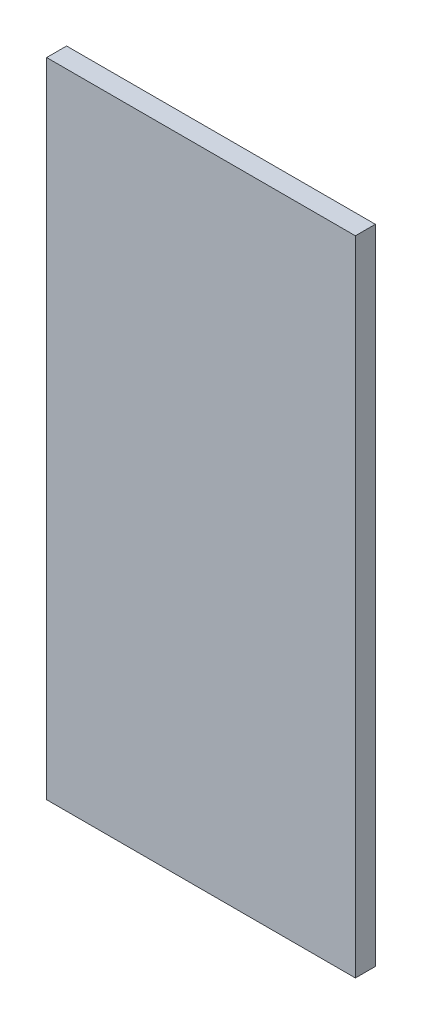
ISO-10303-21;
HEADER;
FILE_DESCRIPTION(('STEP AP214'),'2;1');
FILE_NAME('part.step','',(''),(''),'','','');
FILE_SCHEMA(('AUTOMOTIVE_DESIGN { 1 0 10303 214 1 1 1 1 }'));
ENDSEC;
DATA;
#1=APPLICATION_CONTEXT('core data for automotive mechanical design processes');
#2=APPLICATION_PROTOCOL_DEFINITION('international standard','automotive_design',2000,#1);
#3=PRODUCT_CONTEXT('',#1,'mechanical');
#4=PRODUCT('Part','Part','',(#3));
#5=PRODUCT_RELATED_PRODUCT_CATEGORY('part','',(#4));
#6=PRODUCT_DEFINITION_FORMATION('','',#4);
#7=PRODUCT_DEFINITION_CONTEXT('part definition',#1,'design');
#8=PRODUCT_DEFINITION('design','',#6,#7);
#9=PRODUCT_DEFINITION_SHAPE('','',#8);
#10=(LENGTH_UNIT() NAMED_UNIT(*) SI_UNIT(.MILLI.,.METRE.));
#11=(NAMED_UNIT(*) PLANE_ANGLE_UNIT() SI_UNIT($,.RADIAN.));
#12=(NAMED_UNIT(*) SI_UNIT($,.STERADIAN.) SOLID_ANGLE_UNIT());
#13=UNCERTAINTY_MEASURE_WITH_UNIT(LENGTH_MEASURE(1.E-05),#10,'distance_accuracy_value','');
#14=(GEOMETRIC_REPRESENTATION_CONTEXT(3) GLOBAL_UNCERTAINTY_ASSIGNED_CONTEXT((#13)) GLOBAL_UNIT_ASSIGNED_CONTEXT((#10,
#11,#12)) REPRESENTATION_CONTEXT('',''));
#15=CARTESIAN_POINT('',(0.,0.,0.));
#16=DIRECTION('',(0.,0.,1.));
#17=DIRECTION('',(1.,0.,0.));
#18=AXIS2_PLACEMENT_3D('',#15,#16,#17);
#19=CARTESIAN_POINT('',(89.4420013427734,100.66300201416,0.));
#20=DIRECTION('',(1.,0.,0.));
#21=DIRECTION('',(0.,-1.,0.));
#22=AXIS2_PLACEMENT_3D('',#19,#20,#21);
#23=PLANE('',#22);
#24=DIRECTION('',(0.,-1.,0.));
#25=VECTOR('',#24,1.);
#26=CARTESIAN_POINT('',(89.4420013427734,100.66300201416,0.03556));
#27=LINE('',#26,#25);
#28=CARTESIAN_POINT('',(89.4420013427734,100.66300201416,0.03556));
#29=VERTEX_POINT('',#28);
#30=CARTESIAN_POINT('',(89.4420013427734,99.5179977416992,0.03556));
#31=VERTEX_POINT('',#30);
#32=EDGE_CURVE('E11',#29,#31,#27,.T.);
#33=ORIENTED_EDGE('',*,*,#32,.F.);
#34=DIRECTION('',(0.,0.,1.));
#35=VECTOR('',#34,1.);
#36=CARTESIAN_POINT('',(89.4420013427734,100.66300201416,0.));
#37=LINE('',#36,#35);
#38=CARTESIAN_POINT('',(89.4420013427734,100.66300201416,0.));
#39=VERTEX_POINT('',#38);
#40=EDGE_CURVE('E24',#39,#29,#37,.T.);
#41=ORIENTED_EDGE('',*,*,#40,.F.);
#42=DIRECTION('',(0.,-1.,0.));
#43=VECTOR('',#42,1.);
#44=CARTESIAN_POINT('',(89.4420013427734,100.66300201416,0.));
#45=LINE('',#44,#43);
#46=CARTESIAN_POINT('',(89.4420013427734,99.5179977416992,0.));
#47=VERTEX_POINT('',#46);
#48=EDGE_CURVE('E75',#39,#47,#45,.T.);
#49=ORIENTED_EDGE('',*,*,#48,.T.);
#50=DIRECTION('',(0.,0.,1.));
#51=VECTOR('',#50,1.);
#52=CARTESIAN_POINT('',(89.4420013427734,99.5179977416992,0.));
#53=LINE('',#52,#51);
#54=EDGE_CURVE('E37',#47,#31,#53,.T.);
#55=ORIENTED_EDGE('',*,*,#54,.T.);
#56=EDGE_LOOP('',(#33,#41,#49,#55));
#57=FACE_BOUND('',#56,.T.);
#58=ADVANCED_FACE('F17',(#57),#23,.F.);
#59=CARTESIAN_POINT('',(89.4420013427734,99.5179977416992,0.));
#60=DIRECTION('',(0.,1.,0.));
#61=DIRECTION('',(1.,0.,0.));
#62=AXIS2_PLACEMENT_3D('',#59,#60,#61);
#63=PLANE('',#62);
#64=DIRECTION('',(1.,0.,0.));
#65=VECTOR('',#64,1.);
#66=CARTESIAN_POINT('',(89.4420013427734,99.5179977416992,0.03556));
#67=LINE('',#66,#65);
#68=CARTESIAN_POINT('',(89.9919967651367,99.5179977416992,0.03556));
#69=VERTEX_POINT('',#68);
#70=EDGE_CURVE('E83',#31,#69,#67,.T.);
#71=ORIENTED_EDGE('',*,*,#70,.F.);
#72=ORIENTED_EDGE('',*,*,#54,.F.);
#73=DIRECTION('',(1.,0.,0.));
#74=VECTOR('',#73,1.);
#75=CARTESIAN_POINT('',(89.4420013427734,99.5179977416992,0.));
#76=LINE('',#75,#74);
#77=CARTESIAN_POINT('',(89.9919967651367,99.5179977416992,0.));
#78=VERTEX_POINT('',#77);
#79=EDGE_CURVE('E81',#47,#78,#76,.T.);
#80=ORIENTED_EDGE('',*,*,#79,.T.);
#81=DIRECTION('',(0.,0.,1.));
#82=VECTOR('',#81,1.);
#83=CARTESIAN_POINT('',(89.9919967651367,99.5179977416992,0.));
#84=LINE('',#83,#82);
#85=EDGE_CURVE('E67',#78,#69,#84,.T.);
#86=ORIENTED_EDGE('',*,*,#85,.T.);
#87=EDGE_LOOP('',(#71,#72,#80,#86));
#88=FACE_BOUND('',#87,.T.);
#89=ADVANCED_FACE('F89',(#88),#63,.F.);
#90=CARTESIAN_POINT('',(89.9919967651367,99.5179977416992,0.));
#91=DIRECTION('',(-1.,0.,0.));
#92=DIRECTION('',(0.,1.,0.));
#93=AXIS2_PLACEMENT_3D('',#90,#91,#92);
#94=PLANE('',#93);
#95=DIRECTION('',(0.,1.,0.));
#96=VECTOR('',#95,1.);
#97=CARTESIAN_POINT('',(89.9919967651367,99.5179977416992,0.03556));
#98=LINE('',#97,#96);
#99=CARTESIAN_POINT('',(89.9919967651367,100.66300201416,0.03556));
#100=VERTEX_POINT('',#99);
#101=EDGE_CURVE('E71',#69,#100,#98,.T.);
#102=ORIENTED_EDGE('',*,*,#101,.F.);
#103=ORIENTED_EDGE('',*,*,#85,.F.);
#104=DIRECTION('',(0.,1.,0.));
#105=VECTOR('',#104,1.);
#106=CARTESIAN_POINT('',(89.9919967651367,99.5179977416992,0.));
#107=LINE('',#106,#105);
#108=CARTESIAN_POINT('',(89.9919967651367,100.66300201416,0.));
#109=VERTEX_POINT('',#108);
#110=EDGE_CURVE('E63',#78,#109,#107,.T.);
#111=ORIENTED_EDGE('',*,*,#110,.T.);
#112=DIRECTION('',(0.,0.,1.));
#113=VECTOR('',#112,1.);
#114=CARTESIAN_POINT('',(89.9919967651367,100.66300201416,0.));
#115=LINE('',#114,#113);
#116=EDGE_CURVE('E53',#109,#100,#115,.T.);
#117=ORIENTED_EDGE('',*,*,#116,.T.);
#118=EDGE_LOOP('',(#102,#103,#111,#117));
#119=FACE_BOUND('',#118,.T.);
#120=ADVANCED_FACE('F66',(#119),#94,.F.);
#121=CARTESIAN_POINT('',(89.9919967651367,100.66300201416,0.));
#122=DIRECTION('',(0.,-1.,0.));
#123=DIRECTION('',(-1.,0.,0.));
#124=AXIS2_PLACEMENT_3D('',#121,#122,#123);
#125=PLANE('',#124);
#126=DIRECTION('',(-1.,0.,0.));
#127=VECTOR('',#126,1.);
#128=CARTESIAN_POINT('',(89.9919967651367,100.66300201416,0.03556));
#129=LINE('',#128,#127);
#130=EDGE_CURVE('E59',#100,#29,#129,.T.);
#131=ORIENTED_EDGE('',*,*,#130,.F.);
#132=ORIENTED_EDGE('',*,*,#116,.F.);
#133=DIRECTION('',(-1.,0.,0.));
#134=VECTOR('',#133,1.);
#135=CARTESIAN_POINT('',(89.9919967651367,100.66300201416,0.));
#136=LINE('',#135,#134);
#137=EDGE_CURVE('E57',#109,#39,#136,.T.);
#138=ORIENTED_EDGE('',*,*,#137,.T.);
#139=ORIENTED_EDGE('',*,*,#40,.T.);
#140=EDGE_LOOP('',(#131,#132,#138,#139));
#141=FACE_BOUND('',#140,.T.);
#142=ADVANCED_FACE('F55',(#141),#125,.F.);
#143=CARTESIAN_POINT('',(89.4420013427734,100.66300201416,0.));
#144=DIRECTION('',(0.,0.,-1.));
#145=DIRECTION('',(-1.,0.,0.));
#146=AXIS2_PLACEMENT_3D('',#143,#144,#145);
#147=PLANE('',#146);
#148=ORIENTED_EDGE('',*,*,#137,.F.);
#149=ORIENTED_EDGE('',*,*,#110,.F.);
#150=ORIENTED_EDGE('',*,*,#79,.F.);
#151=ORIENTED_EDGE('',*,*,#48,.F.);
#152=EDGE_LOOP('',(#148,#149,#150,#151));
#153=FACE_BOUND('',#152,.T.);
#154=ADVANCED_FACE('F74',(#153),#147,.T.);
#155=CARTESIAN_POINT('',(89.4420013427734,100.66300201416,0.03556));
#156=DIRECTION('',(0.,0.,-1.));
#157=DIRECTION('',(-1.,0.,0.));
#158=AXIS2_PLACEMENT_3D('',#155,#156,#157);
#159=PLANE('',#158);
#160=ORIENTED_EDGE('',*,*,#32,.T.);
#161=ORIENTED_EDGE('',*,*,#70,.T.);
#162=ORIENTED_EDGE('',*,*,#101,.T.);
#163=ORIENTED_EDGE('',*,*,#130,.T.);
#164=EDGE_LOOP('',(#160,#161,#162,#163));
#165=FACE_BOUND('',#164,.T.);
#166=ADVANCED_FACE('F91',(#165),#159,.F.);
#167=CLOSED_SHELL('',(#58,#89,#120,#142,#154,#166));
#168=MANIFOLD_SOLID_BREP('B1',#167);
#169=ADVANCED_BREP_SHAPE_REPRESENTATION('',(#18,#168),#14);
#170=SHAPE_DEFINITION_REPRESENTATION(#9,#169);
ENDSEC;
END-ISO-10303-21;
